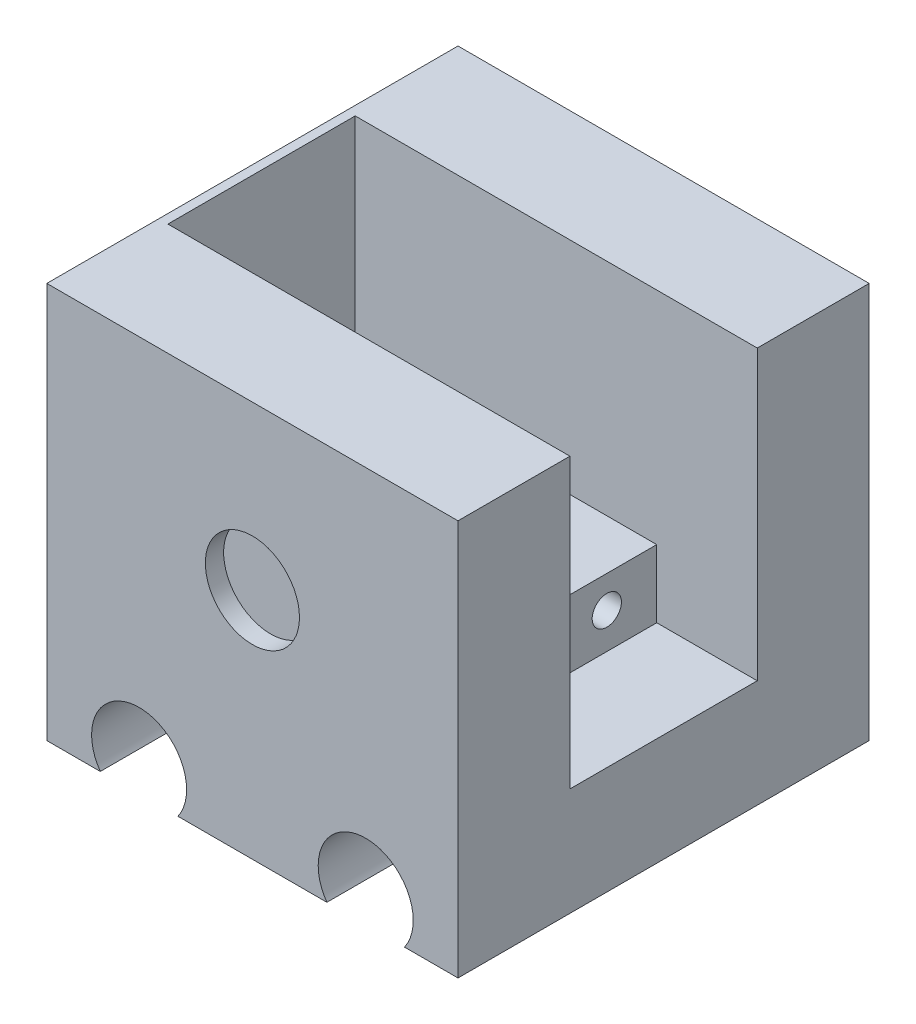
ISO-10303-21;
HEADER;
FILE_DESCRIPTION(('STEP AP214'),'2;1');
FILE_NAME('part.step','',(''),(''),'','','');
FILE_SCHEMA(('AUTOMOTIVE_DESIGN { 1 0 10303 214 1 1 1 1 }'));
ENDSEC;
DATA;
#1=APPLICATION_CONTEXT('core data for automotive mechanical design processes');
#2=APPLICATION_PROTOCOL_DEFINITION('international standard','automotive_design',2000,#1);
#3=PRODUCT_CONTEXT('',#1,'mechanical');
#4=PRODUCT('Part','Part','',(#3));
#5=PRODUCT_RELATED_PRODUCT_CATEGORY('part','',(#4));
#6=PRODUCT_DEFINITION_FORMATION('','',#4);
#7=PRODUCT_DEFINITION_CONTEXT('part definition',#1,'design');
#8=PRODUCT_DEFINITION('design','',#6,#7);
#9=PRODUCT_DEFINITION_SHAPE('','',#8);
#10=(LENGTH_UNIT() NAMED_UNIT(*) SI_UNIT(.MILLI.,.METRE.));
#11=(NAMED_UNIT(*) PLANE_ANGLE_UNIT() SI_UNIT($,.RADIAN.));
#12=(NAMED_UNIT(*) SI_UNIT($,.STERADIAN.) SOLID_ANGLE_UNIT());
#13=UNCERTAINTY_MEASURE_WITH_UNIT(LENGTH_MEASURE(1.E-05),#10,'distance_accuracy_value','');
#14=(GEOMETRIC_REPRESENTATION_CONTEXT(3) GLOBAL_UNCERTAINTY_ASSIGNED_CONTEXT((#13)) GLOBAL_UNIT_ASSIGNED_CONTEXT((#10,
#11,#12)) REPRESENTATION_CONTEXT('',''));
#15=CARTESIAN_POINT('',(0.,0.,0.));
#16=DIRECTION('',(0.,0.,1.));
#17=DIRECTION('',(1.,0.,0.));
#18=AXIS2_PLACEMENT_3D('',#15,#16,#17);
#19=CARTESIAN_POINT('',(-13.2633928571429,-8.69902762471982,32.5));
#20=DIRECTION('',(0.,1.,0.));
#21=DIRECTION('',(-1.,0.,0.));
#22=AXIS2_PLACEMENT_3D('',#19,#20,#21);
#23=PLANE('',#22);
#24=DIRECTION('',(-1.,0.,0.));
#25=VECTOR('',#24,1.);
#26=CARTESIAN_POINT('',(-14.2633928571429,-8.69902762471982,18.));
#27=LINE('',#26,#25);
#28=CARTESIAN_POINT('',(-1.17536263120211,-8.69902762471982,18.));
#29=VERTEX_POINT('',#28);
#30=CARTESIAN_POINT('',(-13.2633928571429,-8.69902762471986,18.));
#31=VERTEX_POINT('',#30);
#32=EDGE_CURVE('E195',#29,#31,#27,.T.);
#33=ORIENTED_EDGE('',*,*,#32,.F.);
#34=DIRECTION('',(0.,0.,-1.));
#35=VECTOR('',#34,1.);
#36=CARTESIAN_POINT('',(-1.17536263120211,-8.69902762471982,18.));
#37=LINE('',#36,#35);
#38=CARTESIAN_POINT('',(-1.17536263120211,-8.69902762471982,27.));
#39=VERTEX_POINT('',#38);
#40=EDGE_CURVE('E212',#39,#29,#37,.T.);
#41=ORIENTED_EDGE('',*,*,#40,.F.);
#42=DIRECTION('',(1.,0.,0.));
#43=VECTOR('',#42,1.);
#44=CARTESIAN_POINT('',(-14.2633928571429,-8.69902762471982,27.));
#45=LINE('',#44,#43);
#46=CARTESIAN_POINT('',(-13.2633928571429,-8.69902762471982,27.));
#47=VERTEX_POINT('',#46);
#48=EDGE_CURVE('E201',#47,#39,#45,.T.);
#49=ORIENTED_EDGE('',*,*,#48,.F.);
#50=DIRECTION('',(0.,0.,1.));
#51=VECTOR('',#50,1.);
#52=CARTESIAN_POINT('',(-13.2633928571429,-8.69902762471982,32.5));
#53=LINE('',#52,#51);
#54=CARTESIAN_POINT('',(-13.2633928571429,-8.69902762471981,32.75));
#55=VERTEX_POINT('',#54);
#56=EDGE_CURVE('E68',#47,#55,#53,.T.);
#57=ORIENTED_EDGE('',*,*,#56,.T.);
#58=DIRECTION('',(1.,0.,0.));
#59=VECTOR('',#58,1.);
#60=CARTESIAN_POINT('',(-13.2633928571429,-8.69902762471982,32.75));
#61=LINE('',#60,#59);
#62=CARTESIAN_POINT('',(19.7366071428571,-8.69902762471981,32.75));
#63=VERTEX_POINT('',#62);
#64=EDGE_CURVE('E300',#55,#63,#61,.T.);
#65=ORIENTED_EDGE('',*,*,#64,.T.);
#66=DIRECTION('',(0.,0.,1.));
#67=VECTOR('',#66,1.);
#68=CARTESIAN_POINT('',(19.7366071428571,-8.69902762471981,32.75));
#69=LINE('',#68,#67);
#70=CARTESIAN_POINT('',(19.7366071428571,-8.69902762471981,12.25));
#71=VERTEX_POINT('',#70);
#72=EDGE_CURVE('E281',#71,#63,#69,.T.);
#73=ORIENTED_EDGE('',*,*,#72,.F.);
#74=DIRECTION('',(1.,0.,0.));
#75=VECTOR('',#74,1.);
#76=CARTESIAN_POINT('',(-13.2633928571429,-8.69902762471982,12.25));
#77=LINE('',#76,#75);
#78=CARTESIAN_POINT('',(-13.2633928571429,-8.69902762471982,12.25));
#79=VERTEX_POINT('',#78);
#80=EDGE_CURVE('E301',#79,#71,#77,.T.);
#81=ORIENTED_EDGE('',*,*,#80,.F.);
#82=EDGE_CURVE('E60',#79,#31,#53,.T.);
#83=ORIENTED_EDGE('',*,*,#82,.T.);
#84=EDGE_LOOP('',(#33,#41,#49,#57,#65,#73,#81,#83));
#85=FACE_BOUND('',#84,.T.);
#86=ADVANCED_FACE('F44',(#85),#23,.T.);
#87=CARTESIAN_POINT('',(-14.2633928571429,22.0982142857143,45.));
#88=DIRECTION('',(1.,0.,0.));
#89=DIRECTION('',(0.,1.,0.));
#90=AXIS2_PLACEMENT_3D('',#87,#88,#89);
#91=PLANE('',#90);
#92=DIRECTION('',(0.,-1.,0.));
#93=VECTOR('',#92,1.);
#94=CARTESIAN_POINT('',(-14.2633928571429,22.0982142857143,45.));
#95=LINE('',#94,#93);
#96=CARTESIAN_POINT('',(-14.2633928571429,15.4307429063089,45.));
#97=VERTEX_POINT('',#96);
#98=CARTESIAN_POINT('',(-14.2633928571429,-27.9017857142857,45.));
#99=VERTEX_POINT('',#98);
#100=EDGE_CURVE('E371',#97,#99,#95,.T.);
#101=ORIENTED_EDGE('',*,*,#100,.F.);
#102=DIRECTION('',(0.,0.,1.));
#103=VECTOR('',#102,1.);
#104=CARTESIAN_POINT('',(-14.2633928571429,15.4307429063089,0.));
#105=LINE('',#104,#103);
#106=CARTESIAN_POINT('',(-14.2633928571429,15.4307429063089,0.));
#107=VERTEX_POINT('',#106);
#108=EDGE_CURVE('E316',#107,#97,#105,.T.);
#109=ORIENTED_EDGE('',*,*,#108,.F.);
#110=DIRECTION('',(0.,-1.,0.));
#111=VECTOR('',#110,1.);
#112=CARTESIAN_POINT('',(-14.2633928571429,22.0982142857143,0.));
#113=LINE('',#112,#111);
#114=CARTESIAN_POINT('',(-14.2633928571429,-27.9017857142857,0.));
#115=VERTEX_POINT('',#114);
#116=EDGE_CURVE('E370',#107,#115,#113,.T.);
#117=ORIENTED_EDGE('',*,*,#116,.T.);
#118=DIRECTION('',(0.,0.,-1.));
#119=VECTOR('',#118,1.);
#120=CARTESIAN_POINT('',(-14.2633928571429,-27.9017857142857,45.));
#121=LINE('',#120,#119);
#122=EDGE_CURVE('E400',#99,#115,#121,.T.);
#123=ORIENTED_EDGE('',*,*,#122,.F.);
#124=EDGE_LOOP('',(#101,#109,#117,#123));
#125=FACE_BOUND('',#124,.T.);
#126=DIRECTION('',(0.,0.,1.));
#127=VECTOR('',#126,1.);
#128=CARTESIAN_POINT('',(-14.2633928571429,-15.6990276247198,45.));
#129=LINE('',#128,#127);
#130=CARTESIAN_POINT('',(-14.2633928571429,-15.6990276247198,18.));
#131=VERTEX_POINT('',#130);
#132=CARTESIAN_POINT('',(-14.2633928571429,-15.6990276247198,27.));
#133=VERTEX_POINT('',#132);
#134=EDGE_CURVE('E190',#131,#133,#129,.T.);
#135=ORIENTED_EDGE('',*,*,#134,.F.);
#136=DIRECTION('',(0.,1.,0.));
#137=VECTOR('',#136,1.);
#138=CARTESIAN_POINT('',(-14.2633928571429,22.0982142857143,18.));
#139=LINE('',#138,#137);
#140=CARTESIAN_POINT('',(-14.2633928571429,-3.65266937117781,18.));
#141=VERTEX_POINT('',#140);
#142=EDGE_CURVE('E256',#131,#141,#139,.T.);
#143=ORIENTED_EDGE('',*,*,#142,.T.);
#144=DIRECTION('',(0.,0.,1.));
#145=VECTOR('',#144,1.);
#146=CARTESIAN_POINT('',(-14.2633928571429,-3.65266937117781,45.));
#147=LINE('',#146,#145);
#148=CARTESIAN_POINT('',(-14.2633928571429,-3.65266937117781,27.));
#149=VERTEX_POINT('',#148);
#150=EDGE_CURVE('E262',#141,#149,#147,.T.);
#151=ORIENTED_EDGE('',*,*,#150,.T.);
#152=DIRECTION('',(0.,-1.,0.));
#153=VECTOR('',#152,1.);
#154=CARTESIAN_POINT('',(-14.2633928571429,22.0982142857143,27.));
#155=LINE('',#154,#153);
#156=EDGE_CURVE('E266',#149,#133,#155,.T.);
#157=ORIENTED_EDGE('',*,*,#156,.T.);
#158=EDGE_LOOP('',(#135,#143,#151,#157));
#159=FACE_BOUND('',#158,.T.);
#160=ADVANCED_FACE('F46',(#125,#159),#91,.F.);
#161=CARTESIAN_POINT('',(-13.2633928571429,0.,0.));
#162=DIRECTION('',(-1.,0.,0.));
#163=DIRECTION('',(0.,-1.,0.));
#164=AXIS2_PLACEMENT_3D('',#161,#162,#163);
#165=PLANE('',#164);
#166=ORIENTED_EDGE('',*,*,#56,.F.);
#167=DIRECTION('',(0.,-1.,0.));
#168=VECTOR('',#167,1.);
#169=CARTESIAN_POINT('',(-13.2633928571429,-8.69902762471986,27.));
#170=LINE('',#169,#168);
#171=CARTESIAN_POINT('',(-13.2633928571429,-3.65266937117781,27.));
#172=VERTEX_POINT('',#171);
#173=EDGE_CURVE('E237',#172,#47,#170,.T.);
#174=ORIENTED_EDGE('',*,*,#173,.F.);
#175=DIRECTION('',(0.,0.,1.));
#176=VECTOR('',#175,1.);
#177=CARTESIAN_POINT('',(-13.2633928571429,-3.65266937117781,27.));
#178=LINE('',#177,#176);
#179=CARTESIAN_POINT('',(-13.2633928571429,-3.65266937117781,18.));
#180=VERTEX_POINT('',#179);
#181=EDGE_CURVE('E248',#180,#172,#178,.T.);
#182=ORIENTED_EDGE('',*,*,#181,.F.);
#183=DIRECTION('',(0.,1.,0.));
#184=VECTOR('',#183,1.);
#185=CARTESIAN_POINT('',(-13.2633928571429,-8.69902762471986,18.));
#186=LINE('',#185,#184);
#187=EDGE_CURVE('E244',#31,#180,#186,.T.);
#188=ORIENTED_EDGE('',*,*,#187,.F.);
#189=ORIENTED_EDGE('',*,*,#82,.F.);
#190=DIRECTION('',(0.,1.,0.));
#191=VECTOR('',#190,1.);
#192=CARTESIAN_POINT('',(-13.2633928571428,-16.5,12.25));
#193=LINE('',#192,#191);
#194=CARTESIAN_POINT('',(-13.2633928571429,15.4307429063089,12.25));
#195=VERTEX_POINT('',#194);
#196=EDGE_CURVE('E312',#79,#195,#193,.T.);
#197=ORIENTED_EDGE('',*,*,#196,.T.);
#198=DIRECTION('',(0.,0.,-1.));
#199=VECTOR('',#198,1.);
#200=CARTESIAN_POINT('',(-13.2633928571429,15.4307429063089,0.));
#201=LINE('',#200,#199);
#202=CARTESIAN_POINT('',(-13.2633928571429,15.4307429063089,32.75));
#203=VERTEX_POINT('',#202);
#204=EDGE_CURVE('E416',#203,#195,#201,.T.);
#205=ORIENTED_EDGE('',*,*,#204,.F.);
#206=DIRECTION('',(0.,-1.,0.));
#207=VECTOR('',#206,1.);
#208=CARTESIAN_POINT('',(-13.2633928571428,-16.5,32.75));
#209=LINE('',#208,#207);
#210=EDGE_CURVE('E308',#203,#55,#209,.T.);
#211=ORIENTED_EDGE('',*,*,#210,.T.);
#212=EDGE_LOOP('',(#166,#174,#182,#188,#189,#197,#205,#211));
#213=FACE_BOUND('',#212,.T.);
#214=ADVANCED_FACE('F473',(#213),#165,.F.);
#215=CARTESIAN_POINT('',(-14.2633928571429,-27.9017857142857,45.));
#216=DIRECTION('',(0.,1.,0.));
#217=DIRECTION('',(0.,0.,1.));
#218=AXIS2_PLACEMENT_3D('',#215,#216,#217);
#219=PLANE('',#218);
#220=DIRECTION('',(1.,0.,0.));
#221=VECTOR('',#220,1.);
#222=CARTESIAN_POINT('',(-14.2633928571429,-27.9017857142857,0.));
#223=LINE('',#222,#221);
#224=CARTESIAN_POINT('',(-8.41074497346191,-27.9017857142857,0.));
#225=VERTEX_POINT('',#224);
#226=EDGE_CURVE('E389',#115,#225,#223,.T.);
#227=ORIENTED_EDGE('',*,*,#226,.T.);
#228=DIRECTION('',(0.,0.,1.));
#229=VECTOR('',#228,1.);
#230=CARTESIAN_POINT('',(-8.41074497346191,-27.9017857142857,0.));
#231=LINE('',#230,#229);
#232=CARTESIAN_POINT('',(-8.41074497346191,-27.9017857142857,45.));
#233=VERTEX_POINT('',#232);
#234=EDGE_CURVE('E366',#225,#233,#231,.T.);
#235=ORIENTED_EDGE('',*,*,#234,.T.);
#236=DIRECTION('',(1.,0.,0.));
#237=VECTOR('',#236,1.);
#238=CARTESIAN_POINT('',(-14.2633928571429,-27.9017857142857,45.));
#239=LINE('',#238,#237);
#240=EDGE_CURVE('E376',#99,#233,#239,.T.);
#241=ORIENTED_EDGE('',*,*,#240,.F.);
#242=ORIENTED_EDGE('',*,*,#122,.T.);
#243=EDGE_LOOP('',(#227,#235,#241,#242));
#244=FACE_BOUND('',#243,.T.);
#245=ADVANCED_FACE('F449',(#244),#219,.F.);
#246=CARTESIAN_POINT('',(0.0839592591762011,-27.9017857142857,45.));
#247=VERTEX_POINT('',#246);
#248=CARTESIAN_POINT('',(16.3892550265381,-27.9017857142857,45.));
#249=VERTEX_POINT('',#248);
#250=EDGE_CURVE('E381',#247,#249,#239,.T.);
#251=ORIENTED_EDGE('',*,*,#250,.F.);
#252=DIRECTION('',(0.,0.,1.));
#253=VECTOR('',#252,1.);
#254=CARTESIAN_POINT('',(0.0839592591762002,-27.9017857142857,0.));
#255=LINE('',#254,#253);
#256=CARTESIAN_POINT('',(0.0839592591762011,-27.9017857142857,0.));
#257=VERTEX_POINT('',#256);
#258=EDGE_CURVE('E362',#247,#257,#255,.F.);
#259=ORIENTED_EDGE('',*,*,#258,.T.);
#260=CARTESIAN_POINT('',(16.3892550265381,-27.9017857142857,0.));
#261=VERTEX_POINT('',#260);
#262=EDGE_CURVE('E393',#257,#261,#223,.T.);
#263=ORIENTED_EDGE('',*,*,#262,.T.);
#264=DIRECTION('',(0.,0.,1.));
#265=VECTOR('',#264,1.);
#266=CARTESIAN_POINT('',(16.3892550265381,-27.9017857142857,0.));
#267=LINE('',#266,#265);
#268=EDGE_CURVE('E358',#261,#249,#267,.T.);
#269=ORIENTED_EDGE('',*,*,#268,.T.);
#270=EDGE_LOOP('',(#251,#259,#263,#269));
#271=FACE_BOUND('',#270,.T.);
#272=ADVANCED_FACE('F467',(#271),#219,.F.);
#273=CARTESIAN_POINT('',(24.8839592591762,-27.9017857142857,45.));
#274=VERTEX_POINT('',#273);
#275=CARTESIAN_POINT('',(30.7366071428571,-27.9017857142857,45.));
#276=VERTEX_POINT('',#275);
#277=EDGE_CURVE('E374',#274,#276,#239,.T.);
#278=ORIENTED_EDGE('',*,*,#277,.F.);
#279=DIRECTION('',(0.,0.,1.));
#280=VECTOR('',#279,1.);
#281=CARTESIAN_POINT('',(24.8839592591762,-27.9017857142857,0.));
#282=LINE('',#281,#280);
#283=CARTESIAN_POINT('',(24.8839592591762,-27.9017857142857,0.));
#284=VERTEX_POINT('',#283);
#285=EDGE_CURVE('E352',#274,#284,#282,.F.);
#286=ORIENTED_EDGE('',*,*,#285,.T.);
#287=CARTESIAN_POINT('',(30.7366071428571,-27.9017857142857,0.));
#288=VERTEX_POINT('',#287);
#289=EDGE_CURVE('E388',#284,#288,#223,.T.);
#290=ORIENTED_EDGE('',*,*,#289,.T.);
#291=DIRECTION('',(0.,0.,-1.));
#292=VECTOR('',#291,1.);
#293=CARTESIAN_POINT('',(30.7366071428571,-27.9017857142857,45.));
#294=LINE('',#293,#292);
#295=EDGE_CURVE('E385',#276,#288,#294,.T.);
#296=ORIENTED_EDGE('',*,*,#295,.F.);
#297=EDGE_LOOP('',(#278,#286,#290,#296));
#298=FACE_BOUND('',#297,.T.);
#299=ADVANCED_FACE('F459',(#298),#219,.F.);
#300=CARTESIAN_POINT('',(30.7366071428571,22.0982142857143,45.));
#301=DIRECTION('',(-1.,0.,0.));
#302=DIRECTION('',(0.,-1.,0.));
#303=AXIS2_PLACEMENT_3D('',#300,#301,#302);
#304=PLANE('',#303);
#305=DIRECTION('',(0.,0.,-1.));
#306=VECTOR('',#305,1.);
#307=CARTESIAN_POINT('',(30.7366071428571,-16.106856202808,32.75));
#308=LINE('',#307,#306);
#309=CARTESIAN_POINT('',(30.7366071428571,-16.106856202808,32.75));
#310=VERTEX_POINT('',#309);
#311=CARTESIAN_POINT('',(30.7366071428571,-16.106856202808,12.25));
#312=VERTEX_POINT('',#311);
#313=EDGE_CURVE('E269',#310,#312,#308,.T.);
#314=ORIENTED_EDGE('',*,*,#313,.F.);
#315=DIRECTION('',(0.,-1.,0.));
#316=VECTOR('',#315,1.);
#317=CARTESIAN_POINT('',(30.7366071428571,-16.5,32.75));
#318=LINE('',#317,#316);
#319=CARTESIAN_POINT('',(30.7366071428571,15.4307429063089,32.75));
#320=VERTEX_POINT('',#319);
#321=EDGE_CURVE('E305',#320,#310,#318,.T.);
#322=ORIENTED_EDGE('',*,*,#321,.F.);
#323=DIRECTION('',(0.,0.,1.));
#324=VECTOR('',#323,1.);
#325=CARTESIAN_POINT('',(30.7366071428571,15.4307429063089,45.));
#326=LINE('',#325,#324);
#327=CARTESIAN_POINT('',(30.7366071428571,15.4307429063089,45.));
#328=VERTEX_POINT('',#327);
#329=EDGE_CURVE('E327',#320,#328,#326,.T.);
#330=ORIENTED_EDGE('',*,*,#329,.T.);
#331=DIRECTION('',(0.,1.,0.));
#332=VECTOR('',#331,1.);
#333=CARTESIAN_POINT('',(30.7366071428571,22.0982142857143,45.));
#334=LINE('',#333,#332);
#335=EDGE_CURVE('E380',#276,#328,#334,.T.);
#336=ORIENTED_EDGE('',*,*,#335,.F.);
#337=ORIENTED_EDGE('',*,*,#295,.T.);
#338=DIRECTION('',(0.,1.,0.));
#339=VECTOR('',#338,1.);
#340=CARTESIAN_POINT('',(30.7366071428571,22.0982142857143,0.));
#341=LINE('',#340,#339);
#342=CARTESIAN_POINT('',(30.7366071428571,15.4307429063089,0.));
#343=VERTEX_POINT('',#342);
#344=EDGE_CURVE('E375',#288,#343,#341,.T.);
#345=ORIENTED_EDGE('',*,*,#344,.T.);
#346=CARTESIAN_POINT('',(30.7366071428571,15.4307429063089,12.25));
#347=VERTEX_POINT('',#346);
#348=EDGE_CURVE('E328',#343,#347,#326,.T.);
#349=ORIENTED_EDGE('',*,*,#348,.T.);
#350=DIRECTION('',(0.,1.,0.));
#351=VECTOR('',#350,1.);
#352=CARTESIAN_POINT('',(30.7366071428571,-16.5,12.25));
#353=LINE('',#352,#351);
#354=EDGE_CURVE('E313',#312,#347,#353,.T.);
#355=ORIENTED_EDGE('',*,*,#354,.F.);
#356=EDGE_LOOP('',(#314,#322,#330,#336,#337,#345,#349,#355));
#357=FACE_BOUND('',#356,.T.);
#358=ADVANCED_FACE('F428',(#357),#304,.F.);
#359=CARTESIAN_POINT('',(0.,0.,45.));
#360=DIRECTION('',(0.,0.,1.));
#361=DIRECTION('',(1.,0.,0.));
#362=AXIS2_PLACEMENT_3D('',#359,#360,#361);
#363=PLANE('',#362);
#364=DIRECTION('',(-1.,0.,0.));
#365=VECTOR('',#364,1.);
#366=CARTESIAN_POINT('',(31.7366071428572,15.4307429063089,45.));
#367=LINE('',#366,#365);
#368=EDGE_CURVE('E323',#328,#97,#367,.T.);
#369=ORIENTED_EDGE('',*,*,#368,.T.);
#370=ORIENTED_EDGE('',*,*,#100,.T.);
#371=ORIENTED_EDGE('',*,*,#240,.T.);
#372=CARTESIAN_POINT('',(-4.16339285714286,-24.9017857142857,45.));
#373=DIRECTION('',(0.,0.,1.));
#374=DIRECTION('',(1.,0.,0.));
#375=AXIS2_PLACEMENT_3D('',#372,#373,#374);
#376=CIRCLE('',#375,5.2);
#377=EDGE_CURVE('E349',#247,#233,#376,.T.);
#378=ORIENTED_EDGE('',*,*,#377,.F.);
#379=ORIENTED_EDGE('',*,*,#250,.T.);
#380=CARTESIAN_POINT('',(20.6366071428571,-24.9017857142857,45.));
#381=DIRECTION('',(0.,0.,1.));
#382=DIRECTION('',(1.,0.,0.));
#383=AXIS2_PLACEMENT_3D('',#380,#381,#382);
#384=CIRCLE('',#383,5.2);
#385=EDGE_CURVE('E345',#274,#249,#384,.T.);
#386=ORIENTED_EDGE('',*,*,#385,.F.);
#387=ORIENTED_EDGE('',*,*,#277,.T.);
#388=ORIENTED_EDGE('',*,*,#335,.T.);
#389=EDGE_LOOP('',(#369,#370,#371,#378,#379,#386,#387,#388));
#390=FACE_BOUND('',#389,.T.);
#391=CARTESIAN_POINT('',(8.23660714285715,-2.40178571428571,45.));
#392=DIRECTION('',(0.,0.,1.));
#393=DIRECTION('',(1.,0.,0.));
#394=AXIS2_PLACEMENT_3D('',#391,#392,#393);
#395=CIRCLE('',#394,5.15);
#396=CARTESIAN_POINT('',(13.3866071428572,-2.40178571428571,45.));
#397=VERTEX_POINT('',#396);
#398=EDGE_CURVE('E337',#397,#397,#395,.T.);
#399=ORIENTED_EDGE('',*,*,#398,.F.);
#400=EDGE_LOOP('',(#399));
#401=FACE_BOUND('',#400,.T.);
#402=ADVANCED_FACE('F445',(#390,#401),#363,.T.);
#403=CARTESIAN_POINT('',(0.,0.,0.));
#404=DIRECTION('',(0.,0.,1.));
#405=DIRECTION('',(1.,0.,0.));
#406=AXIS2_PLACEMENT_3D('',#403,#404,#405);
#407=PLANE('',#406);
#408=CARTESIAN_POINT('',(8.23660714285714,-2.40178571428571,0.));
#409=DIRECTION('',(0.,0.,-1.));
#410=DIRECTION('',(-1.,0.,0.));
#411=AXIS2_PLACEMENT_3D('',#408,#409,#410);
#412=CIRCLE('',#411,5.15);
#413=CARTESIAN_POINT('',(3.08660714285714,-2.40178571428571,0.));
#414=VERTEX_POINT('',#413);
#415=EDGE_CURVE('E332',#414,#414,#412,.T.);
#416=ORIENTED_EDGE('',*,*,#415,.F.);
#417=EDGE_LOOP('',(#416));
#418=FACE_BOUND('',#417,.T.);
#419=ORIENTED_EDGE('',*,*,#116,.F.);
#420=DIRECTION('',(1.,0.,0.));
#421=VECTOR('',#420,1.);
#422=CARTESIAN_POINT('',(0.,15.4307429063089,0.));
#423=LINE('',#422,#421);
#424=EDGE_CURVE('E412',#107,#343,#423,.T.);
#425=ORIENTED_EDGE('',*,*,#424,.T.);
#426=ORIENTED_EDGE('',*,*,#344,.F.);
#427=ORIENTED_EDGE('',*,*,#289,.F.);
#428=CARTESIAN_POINT('',(20.6366071428571,-24.9017857142857,0.));
#429=DIRECTION('',(0.,0.,1.));
#430=DIRECTION('',(1.,0.,0.));
#431=AXIS2_PLACEMENT_3D('',#428,#429,#430);
#432=CIRCLE('',#431,5.2);
#433=EDGE_CURVE('E404',#284,#261,#432,.T.);
#434=ORIENTED_EDGE('',*,*,#433,.T.);
#435=ORIENTED_EDGE('',*,*,#262,.F.);
#436=CARTESIAN_POINT('',(-4.16339285714286,-24.9017857142857,0.));
#437=DIRECTION('',(0.,0.,1.));
#438=DIRECTION('',(1.,0.,0.));
#439=AXIS2_PLACEMENT_3D('',#436,#437,#438);
#440=CIRCLE('',#439,5.2);
#441=EDGE_CURVE('E408',#257,#225,#440,.T.);
#442=ORIENTED_EDGE('',*,*,#441,.T.);
#443=ORIENTED_EDGE('',*,*,#226,.F.);
#444=EDGE_LOOP('',(#419,#425,#426,#427,#434,#435,#442,#443));
#445=FACE_BOUND('',#444,.T.);
#446=ADVANCED_FACE('F435',(#418,#445),#407,.F.);
#447=CARTESIAN_POINT('',(20.6366071428571,-24.9017857142857,0.));
#448=DIRECTION('',(0.,0.,1.));
#449=DIRECTION('',(1.,0.,0.));
#450=AXIS2_PLACEMENT_3D('',#447,#448,#449);
#451=CYLINDRICAL_SURFACE('',#450,5.2);
#452=ORIENTED_EDGE('',*,*,#433,.F.);
#453=ORIENTED_EDGE('',*,*,#285,.F.);
#454=ORIENTED_EDGE('',*,*,#385,.T.);
#455=ORIENTED_EDGE('',*,*,#268,.F.);
#456=EDGE_LOOP('',(#452,#453,#454,#455));
#457=FACE_BOUND('',#456,.T.);
#458=ADVANCED_FACE('F462',(#457),#451,.F.);
#459=CARTESIAN_POINT('',(-4.16339285714286,-24.9017857142857,0.));
#460=DIRECTION('',(0.,0.,1.));
#461=DIRECTION('',(1.,0.,0.));
#462=AXIS2_PLACEMENT_3D('',#459,#460,#461);
#463=CYLINDRICAL_SURFACE('',#462,5.2);
#464=ORIENTED_EDGE('',*,*,#441,.F.);
#465=ORIENTED_EDGE('',*,*,#258,.F.);
#466=ORIENTED_EDGE('',*,*,#377,.T.);
#467=ORIENTED_EDGE('',*,*,#234,.F.);
#468=EDGE_LOOP('',(#464,#465,#466,#467));
#469=FACE_BOUND('',#468,.T.);
#470=ADVANCED_FACE('F451',(#469),#463,.F.);
#471=CARTESIAN_POINT('',(8.23660714285715,-2.40178571428571,43.));
#472=DIRECTION('',(0.,0.,1.));
#473=DIRECTION('',(1.,0.,0.));
#474=AXIS2_PLACEMENT_3D('',#471,#472,#473);
#475=CYLINDRICAL_SURFACE('',#474,5.15);
#476=CARTESIAN_POINT('',(8.23660714285715,-2.40178571428571,43.));
#477=DIRECTION('',(0.,0.,1.));
#478=DIRECTION('',(1.,0.,0.));
#479=AXIS2_PLACEMENT_3D('',#476,#477,#478);
#480=CIRCLE('',#479,5.15);
#481=CARTESIAN_POINT('',(13.3866071428572,-2.40178571428571,43.));
#482=VERTEX_POINT('',#481);
#483=EDGE_CURVE('E341',#482,#482,#480,.T.);
#484=ORIENTED_EDGE('',*,*,#483,.F.);
#485=EDGE_LOOP('',(#484));
#486=FACE_BOUND('',#485,.T.);
#487=ORIENTED_EDGE('',*,*,#398,.T.);
#488=EDGE_LOOP('',(#487));
#489=FACE_BOUND('',#488,.T.);
#490=ADVANCED_FACE('F507',(#486,#489),#475,.F.);
#491=CARTESIAN_POINT('',(8.23660714285715,-2.40178571428571,43.));
#492=DIRECTION('',(0.,0.,1.));
#493=DIRECTION('',(1.,0.,0.));
#494=AXIS2_PLACEMENT_3D('',#491,#492,#493);
#495=PLANE('',#494);
#496=ORIENTED_EDGE('',*,*,#483,.T.);
#497=EDGE_LOOP('',(#496));
#498=FACE_BOUND('',#497,.T.);
#499=ADVANCED_FACE('F503',(#498),#495,.T.);
#500=CARTESIAN_POINT('',(8.23660714285714,-2.40178571428571,2.));
#501=DIRECTION('',(0.,0.,-1.));
#502=DIRECTION('',(-1.,0.,0.));
#503=AXIS2_PLACEMENT_3D('',#500,#501,#502);
#504=CYLINDRICAL_SURFACE('',#503,5.15);
#505=CARTESIAN_POINT('',(8.23660714285714,-2.40178571428571,2.));
#506=DIRECTION('',(0.,0.,-1.));
#507=DIRECTION('',(-1.,0.,0.));
#508=AXIS2_PLACEMENT_3D('',#505,#506,#507);
#509=CIRCLE('',#508,5.15);
#510=CARTESIAN_POINT('',(3.08660714285714,-2.40178571428571,2.));
#511=VERTEX_POINT('',#510);
#512=EDGE_CURVE('E333',#511,#511,#509,.T.);
#513=ORIENTED_EDGE('',*,*,#512,.F.);
#514=EDGE_LOOP('',(#513));
#515=FACE_BOUND('',#514,.T.);
#516=ORIENTED_EDGE('',*,*,#415,.T.);
#517=EDGE_LOOP('',(#516));
#518=FACE_BOUND('',#517,.T.);
#519=ADVANCED_FACE('F499',(#515,#518),#504,.F.);
#520=CARTESIAN_POINT('',(8.23660714285714,-2.40178571428571,2.));
#521=DIRECTION('',(0.,0.,-1.));
#522=DIRECTION('',(-1.,0.,0.));
#523=AXIS2_PLACEMENT_3D('',#520,#521,#522);
#524=PLANE('',#523);
#525=ORIENTED_EDGE('',*,*,#512,.T.);
#526=EDGE_LOOP('',(#525));
#527=FACE_BOUND('',#526,.T.);
#528=ADVANCED_FACE('F496',(#527),#524,.T.);
#529=CARTESIAN_POINT('',(31.7366071428572,15.4307429063089,0.));
#530=DIRECTION('',(0.,-1.,0.));
#531=DIRECTION('',(1.,0.,0.));
#532=AXIS2_PLACEMENT_3D('',#529,#530,#531);
#533=PLANE('',#532);
#534=ORIENTED_EDGE('',*,*,#329,.F.);
#535=DIRECTION('',(-1.,0.,0.));
#536=VECTOR('',#535,1.);
#537=CARTESIAN_POINT('',(31.7366071428572,15.4307429063089,32.75));
#538=LINE('',#537,#536);
#539=EDGE_CURVE('E11',#320,#203,#538,.T.);
#540=ORIENTED_EDGE('',*,*,#539,.T.);
#541=ORIENTED_EDGE('',*,*,#204,.T.);
#542=DIRECTION('',(1.,0.,0.));
#543=VECTOR('',#542,1.);
#544=CARTESIAN_POINT('',(31.7366071428572,15.4307429063089,12.25));
#545=LINE('',#544,#543);
#546=EDGE_CURVE('E53',#195,#347,#545,.T.);
#547=ORIENTED_EDGE('',*,*,#546,.T.);
#548=ORIENTED_EDGE('',*,*,#348,.F.);
#549=ORIENTED_EDGE('',*,*,#424,.F.);
#550=ORIENTED_EDGE('',*,*,#108,.T.);
#551=ORIENTED_EDGE('',*,*,#368,.F.);
#552=EDGE_LOOP('',(#534,#540,#541,#547,#548,#549,#550,#551));
#553=FACE_BOUND('',#552,.T.);
#554=ADVANCED_FACE('F424',(#553),#533,.F.);
#555=CARTESIAN_POINT('',(-13.2633928571428,-16.5,32.75));
#556=DIRECTION('',(0.,0.,1.));
#557=DIRECTION('',(1.,0.,0.));
#558=AXIS2_PLACEMENT_3D('',#555,#556,#557);
#559=PLANE('',#558);
#560=ORIENTED_EDGE('',*,*,#321,.T.);
#561=DIRECTION('',(1.,0.,0.));
#562=VECTOR('',#561,1.);
#563=CARTESIAN_POINT('',(19.7366071428571,-16.106856202808,32.75));
#564=LINE('',#563,#562);
#565=CARTESIAN_POINT('',(19.7366071428571,-16.106856202808,32.75));
#566=VERTEX_POINT('',#565);
#567=EDGE_CURVE('E285',#566,#310,#564,.T.);
#568=ORIENTED_EDGE('',*,*,#567,.F.);
#569=DIRECTION('',(0.,-1.,0.));
#570=VECTOR('',#569,1.);
#571=CARTESIAN_POINT('',(19.7366071428571,-8.69902762471981,32.75));
#572=LINE('',#571,#570);
#573=EDGE_CURVE('E270',#63,#566,#572,.T.);
#574=ORIENTED_EDGE('',*,*,#573,.F.);
#575=ORIENTED_EDGE('',*,*,#64,.F.);
#576=ORIENTED_EDGE('',*,*,#210,.F.);
#577=ORIENTED_EDGE('',*,*,#539,.F.);
#578=EDGE_LOOP('',(#560,#568,#574,#575,#576,#577));
#579=FACE_BOUND('',#578,.T.);
#580=ADVANCED_FACE('F490',(#579),#559,.F.);
#581=CARTESIAN_POINT('',(-13.2633928571428,-16.5,12.25));
#582=DIRECTION('',(0.,0.,-1.));
#583=DIRECTION('',(-1.,0.,0.));
#584=AXIS2_PLACEMENT_3D('',#581,#582,#583);
#585=PLANE('',#584);
#586=ORIENTED_EDGE('',*,*,#196,.F.);
#587=ORIENTED_EDGE('',*,*,#80,.T.);
#588=DIRECTION('',(0.,1.,0.));
#589=VECTOR('',#588,1.);
#590=CARTESIAN_POINT('',(19.7366071428571,-8.69902762471981,12.25));
#591=LINE('',#590,#589);
#592=CARTESIAN_POINT('',(19.7366071428571,-16.106856202808,12.25));
#593=VERTEX_POINT('',#592);
#594=EDGE_CURVE('E278',#593,#71,#591,.T.);
#595=ORIENTED_EDGE('',*,*,#594,.F.);
#596=DIRECTION('',(1.,0.,0.));
#597=VECTOR('',#596,1.);
#598=CARTESIAN_POINT('',(19.7366071428571,-16.106856202808,12.25));
#599=LINE('',#598,#597);
#600=EDGE_CURVE('E289',#593,#312,#599,.T.);
#601=ORIENTED_EDGE('',*,*,#600,.T.);
#602=ORIENTED_EDGE('',*,*,#354,.T.);
#603=ORIENTED_EDGE('',*,*,#546,.F.);
#604=EDGE_LOOP('',(#586,#587,#595,#601,#602,#603));
#605=FACE_BOUND('',#604,.T.);
#606=ADVANCED_FACE('F487',(#605),#585,.F.);
#607=CARTESIAN_POINT('',(0.,-15.6990276247198,0.));
#608=DIRECTION('',(0.,1.,0.));
#609=DIRECTION('',(-1.,0.,0.));
#610=AXIS2_PLACEMENT_3D('',#607,#608,#609);
#611=PLANE('',#610);
#612=DIRECTION('',(-1.,0.,0.));
#613=VECTOR('',#612,1.);
#614=CARTESIAN_POINT('',(-14.2633928571429,-15.6990276247198,18.));
#615=LINE('',#614,#613);
#616=CARTESIAN_POINT('',(-1.17536263120211,-15.6990276247198,18.));
#617=VERTEX_POINT('',#616);
#618=EDGE_CURVE('E194',#617,#131,#615,.T.);
#619=ORIENTED_EDGE('',*,*,#618,.T.);
#620=ORIENTED_EDGE('',*,*,#134,.T.);
#621=DIRECTION('',(1.,0.,0.));
#622=VECTOR('',#621,1.);
#623=CARTESIAN_POINT('',(-14.2633928571429,-15.6990276247198,27.));
#624=LINE('',#623,#622);
#625=CARTESIAN_POINT('',(-1.17536263120211,-15.6990276247198,27.));
#626=VERTEX_POINT('',#625);
#627=EDGE_CURVE('E184',#133,#626,#624,.T.);
#628=ORIENTED_EDGE('',*,*,#627,.T.);
#629=DIRECTION('',(0.,0.,-1.));
#630=VECTOR('',#629,1.);
#631=CARTESIAN_POINT('',(-1.17536263120211,-15.6990276247198,18.));
#632=LINE('',#631,#630);
#633=EDGE_CURVE('E189',#626,#617,#632,.T.);
#634=ORIENTED_EDGE('',*,*,#633,.T.);
#635=EDGE_LOOP('',(#619,#620,#628,#634));
#636=FACE_BOUND('',#635,.T.);
#637=ADVANCED_FACE('F187',(#636),#611,.T.);
#638=CARTESIAN_POINT('',(19.7366071428571,-16.106856202808,32.75));
#639=DIRECTION('',(0.,-1.,0.));
#640=DIRECTION('',(1.,0.,0.));
#641=AXIS2_PLACEMENT_3D('',#638,#639,#640);
#642=PLANE('',#641);
#643=ORIENTED_EDGE('',*,*,#313,.T.);
#644=ORIENTED_EDGE('',*,*,#600,.F.);
#645=DIRECTION('',(0.,0.,-1.));
#646=VECTOR('',#645,1.);
#647=CARTESIAN_POINT('',(19.7366071428571,-16.106856202808,32.75));
#648=LINE('',#647,#646);
#649=EDGE_CURVE('E274',#566,#593,#648,.T.);
#650=ORIENTED_EDGE('',*,*,#649,.F.);
#651=ORIENTED_EDGE('',*,*,#567,.T.);
#652=EDGE_LOOP('',(#643,#644,#650,#651));
#653=FACE_BOUND('',#652,.T.);
#654=ADVANCED_FACE('F542',(#653),#642,.F.);
#655=CARTESIAN_POINT('',(19.7366071428571,0.,0.));
#656=DIRECTION('',(1.,0.,0.));
#657=DIRECTION('',(0.,1.,0.));
#658=AXIS2_PLACEMENT_3D('',#655,#656,#657);
#659=PLANE('',#658);
#660=CARTESIAN_POINT('',(19.7366071428571,-12.1990276247198,27.2152503407268));
#661=DIRECTION('',(1.,0.,0.));
#662=DIRECTION('',(0.,1.,0.));
#663=AXIS2_PLACEMENT_3D('',#660,#661,#662);
#664=CIRCLE('',#663,1.6);
#665=CARTESIAN_POINT('',(19.7366071428571,-10.5990276247198,27.2152503407268));
#666=VERTEX_POINT('',#665);
#667=EDGE_CURVE('E224',#666,#666,#664,.T.);
#668=ORIENTED_EDGE('',*,*,#667,.F.);
#669=EDGE_LOOP('',(#668));
#670=FACE_BOUND('',#669,.T.);
#671=CARTESIAN_POINT('',(19.7366071428571,-12.1990276247198,17.7152503407268));
#672=DIRECTION('',(1.,0.,0.));
#673=DIRECTION('',(0.,1.,0.));
#674=AXIS2_PLACEMENT_3D('',#671,#672,#673);
#675=CIRCLE('',#674,1.6);
#676=CARTESIAN_POINT('',(19.7366071428571,-10.5990276247198,17.7152503407268));
#677=VERTEX_POINT('',#676);
#678=EDGE_CURVE('E228',#677,#677,#675,.T.);
#679=ORIENTED_EDGE('',*,*,#678,.F.);
#680=EDGE_LOOP('',(#679));
#681=FACE_BOUND('',#680,.T.);
#682=ORIENTED_EDGE('',*,*,#573,.T.);
#683=ORIENTED_EDGE('',*,*,#649,.T.);
#684=ORIENTED_EDGE('',*,*,#594,.T.);
#685=ORIENTED_EDGE('',*,*,#72,.T.);
#686=EDGE_LOOP('',(#682,#683,#684,#685));
#687=FACE_BOUND('',#686,.T.);
#688=ADVANCED_FACE('F545',(#670,#681,#687),#659,.T.);
#689=CARTESIAN_POINT('',(-27.2633928571429,-8.69902762471986,27.));
#690=DIRECTION('',(0.,0.,1.));
#691=DIRECTION('',(1.,0.,0.));
#692=AXIS2_PLACEMENT_3D('',#689,#690,#691);
#693=PLANE('',#692);
#694=DIRECTION('',(1.,0.,0.));
#695=VECTOR('',#694,1.);
#696=CARTESIAN_POINT('',(-27.2633928571429,-3.65266937117781,27.));
#697=LINE('',#696,#695);
#698=EDGE_CURVE('E253',#149,#172,#697,.T.);
#699=ORIENTED_EDGE('',*,*,#698,.T.);
#700=ORIENTED_EDGE('',*,*,#173,.T.);
#701=ORIENTED_EDGE('',*,*,#48,.T.);
#702=DIRECTION('',(0.,1.,0.));
#703=VECTOR('',#702,1.);
#704=CARTESIAN_POINT('',(-1.17536263120211,-15.6990276247198,27.));
#705=LINE('',#704,#703);
#706=EDGE_CURVE('E198',#626,#39,#705,.T.);
#707=ORIENTED_EDGE('',*,*,#706,.F.);
#708=ORIENTED_EDGE('',*,*,#627,.F.);
#709=ORIENTED_EDGE('',*,*,#156,.F.);
#710=EDGE_LOOP('',(#699,#700,#701,#707,#708,#709));
#711=FACE_BOUND('',#710,.T.);
#712=ADVANCED_FACE('F199',(#711),#693,.F.);
#713=CARTESIAN_POINT('',(-27.2633928571429,-3.65266937117781,27.));
#714=DIRECTION('',(0.,1.,0.));
#715=DIRECTION('',(-1.,0.,0.));
#716=AXIS2_PLACEMENT_3D('',#713,#714,#715);
#717=PLANE('',#716);
#718=DIRECTION('',(1.,0.,0.));
#719=VECTOR('',#718,1.);
#720=CARTESIAN_POINT('',(-27.2633928571429,-3.65266937117781,18.));
#721=LINE('',#720,#719);
#722=EDGE_CURVE('E252',#141,#180,#721,.T.);
#723=ORIENTED_EDGE('',*,*,#722,.T.);
#724=ORIENTED_EDGE('',*,*,#181,.T.);
#725=ORIENTED_EDGE('',*,*,#698,.F.);
#726=ORIENTED_EDGE('',*,*,#150,.F.);
#727=EDGE_LOOP('',(#723,#724,#725,#726));
#728=FACE_BOUND('',#727,.T.);
#729=ADVANCED_FACE('F551',(#728),#717,.F.);
#730=CARTESIAN_POINT('',(-27.2633928571429,-8.69902762471986,18.));
#731=DIRECTION('',(0.,0.,-1.));
#732=DIRECTION('',(-1.,0.,0.));
#733=AXIS2_PLACEMENT_3D('',#730,#731,#732);
#734=PLANE('',#733);
#735=ORIENTED_EDGE('',*,*,#142,.F.);
#736=ORIENTED_EDGE('',*,*,#618,.F.);
#737=DIRECTION('',(0.,1.,0.));
#738=VECTOR('',#737,1.);
#739=CARTESIAN_POINT('',(-1.17536263120211,-15.6990276247198,18.));
#740=LINE('',#739,#738);
#741=EDGE_CURVE('E206',#617,#29,#740,.T.);
#742=ORIENTED_EDGE('',*,*,#741,.T.);
#743=ORIENTED_EDGE('',*,*,#32,.T.);
#744=ORIENTED_EDGE('',*,*,#187,.T.);
#745=ORIENTED_EDGE('',*,*,#722,.F.);
#746=EDGE_LOOP('',(#735,#736,#742,#743,#744,#745));
#747=FACE_BOUND('',#746,.T.);
#748=ADVANCED_FACE('F554',(#747),#734,.F.);
#749=CARTESIAN_POINT('',(9.73660714285715,-12.1990276247198,17.7152503407268));
#750=DIRECTION('',(1.,0.,0.));
#751=DIRECTION('',(0.,1.,0.));
#752=AXIS2_PLACEMENT_3D('',#749,#750,#751);
#753=CYLINDRICAL_SURFACE('',#752,1.6);
#754=CARTESIAN_POINT('',(9.73660714285715,-12.1990276247198,17.7152503407268));
#755=DIRECTION('',(1.,0.,0.));
#756=DIRECTION('',(0.,1.,0.));
#757=AXIS2_PLACEMENT_3D('',#754,#755,#756);
#758=CIRCLE('',#757,1.6);
#759=CARTESIAN_POINT('',(9.73660714285715,-10.5990276247198,17.7152503407268));
#760=VERTEX_POINT('',#759);
#761=EDGE_CURVE('E218',#760,#760,#758,.T.);
#762=ORIENTED_EDGE('',*,*,#761,.F.);
#763=EDGE_LOOP('',(#762));
#764=FACE_BOUND('',#763,.T.);
#765=ORIENTED_EDGE('',*,*,#678,.T.);
#766=EDGE_LOOP('',(#765));
#767=FACE_BOUND('',#766,.T.);
#768=ADVANCED_FACE('F580',(#764,#767),#753,.F.);
#769=CARTESIAN_POINT('',(9.73660714285715,-12.1990276247198,17.7152503407268));
#770=DIRECTION('',(1.,0.,0.));
#771=DIRECTION('',(0.,1.,0.));
#772=AXIS2_PLACEMENT_3D('',#769,#770,#771);
#773=PLANE('',#772);
#774=ORIENTED_EDGE('',*,*,#761,.T.);
#775=EDGE_LOOP('',(#774));
#776=FACE_BOUND('',#775,.T.);
#777=ADVANCED_FACE('F584',(#776),#773,.T.);
#778=CARTESIAN_POINT('',(9.73660714285715,-12.1990276247198,27.2152503407268));
#779=DIRECTION('',(1.,0.,0.));
#780=DIRECTION('',(0.,1.,0.));
#781=AXIS2_PLACEMENT_3D('',#778,#779,#780);
#782=CYLINDRICAL_SURFACE('',#781,1.6);
#783=CARTESIAN_POINT('',(9.73660714285715,-12.1990276247198,27.2152503407268));
#784=DIRECTION('',(1.,0.,0.));
#785=DIRECTION('',(0.,1.,0.));
#786=AXIS2_PLACEMENT_3D('',#783,#784,#785);
#787=CIRCLE('',#786,1.6);
#788=CARTESIAN_POINT('',(9.73660714285715,-10.5990276247198,27.2152503407268));
#789=VERTEX_POINT('',#788);
#790=EDGE_CURVE('E220',#789,#789,#787,.T.);
#791=ORIENTED_EDGE('',*,*,#790,.F.);
#792=EDGE_LOOP('',(#791));
#793=FACE_BOUND('',#792,.T.);
#794=ORIENTED_EDGE('',*,*,#667,.T.);
#795=EDGE_LOOP('',(#794));
#796=FACE_BOUND('',#795,.T.);
#797=ADVANCED_FACE('F594',(#793,#796),#782,.F.);
#798=CARTESIAN_POINT('',(9.73660714285715,-12.1990276247198,27.2152503407268));
#799=DIRECTION('',(1.,0.,0.));
#800=DIRECTION('',(0.,1.,0.));
#801=AXIS2_PLACEMENT_3D('',#798,#799,#800);
#802=PLANE('',#801);
#803=ORIENTED_EDGE('',*,*,#790,.T.);
#804=EDGE_LOOP('',(#803));
#805=FACE_BOUND('',#804,.T.);
#806=ADVANCED_FACE('F602',(#805),#802,.T.);
#807=CARTESIAN_POINT('',(-1.17536263120211,-15.6990276247198,18.));
#808=DIRECTION('',(1.,0.,0.));
#809=DIRECTION('',(0.,1.,0.));
#810=AXIS2_PLACEMENT_3D('',#807,#808,#809);
#811=PLANE('',#810);
#812=ORIENTED_EDGE('',*,*,#40,.T.);
#813=ORIENTED_EDGE('',*,*,#741,.F.);
#814=ORIENTED_EDGE('',*,*,#633,.F.);
#815=ORIENTED_EDGE('',*,*,#706,.T.);
#816=EDGE_LOOP('',(#812,#813,#814,#815));
#817=FACE_BOUND('',#816,.T.);
#818=ADVANCED_FACE('F209',(#817),#811,.F.);
#819=CLOSED_SHELL('',(#86,#160,#214,#245,#272,#299,#358,#402,#446,#458,#470,#490,#499,#519,#528,
#554,#580,#606,#637,#654,#688,#712,#729,#748,#768,#777,#797,#806,#818));
#820=MANIFOLD_SOLID_BREP('B2',#819);
#821=ADVANCED_BREP_SHAPE_REPRESENTATION('',(#18,#820),#14);
#822=SHAPE_DEFINITION_REPRESENTATION(#9,#821);
ENDSEC;
END-ISO-10303-21;
